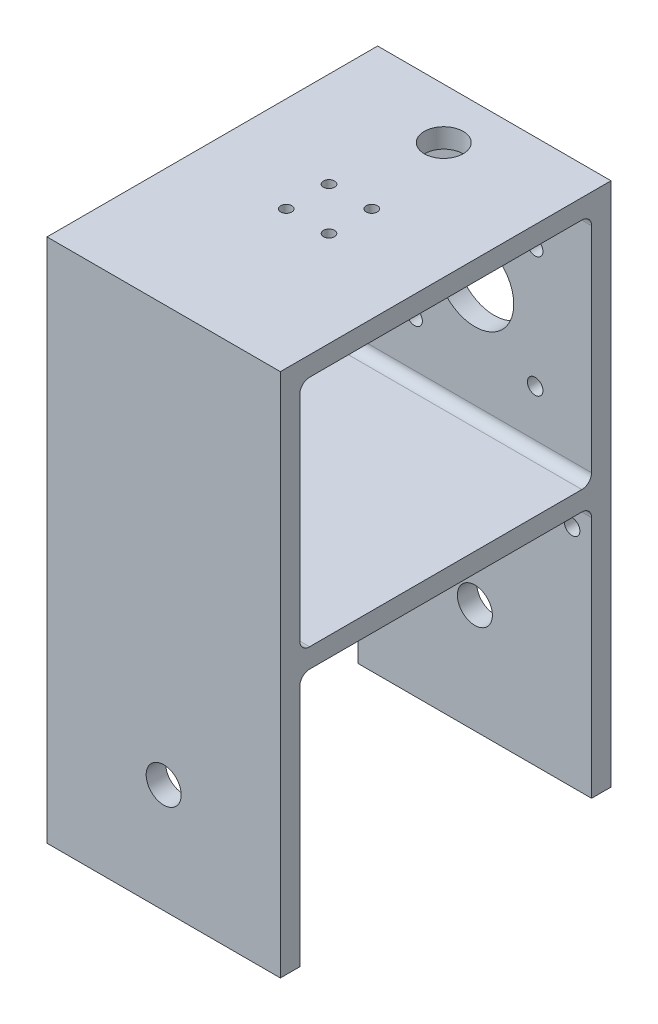
ISO-10303-21;
HEADER;
FILE_DESCRIPTION(('STEP AP214'),'2;1');
FILE_NAME('part.step','',(''),(''),'','','');
FILE_SCHEMA(('AUTOMOTIVE_DESIGN { 1 0 10303 214 1 1 1 1 }'));
ENDSEC;
DATA;
#1=APPLICATION_CONTEXT('core data for automotive mechanical design processes');
#2=APPLICATION_PROTOCOL_DEFINITION('international standard','automotive_design',2000,#1);
#3=PRODUCT_CONTEXT('',#1,'mechanical');
#4=PRODUCT('Part','Part','',(#3));
#5=PRODUCT_RELATED_PRODUCT_CATEGORY('part','',(#4));
#6=PRODUCT_DEFINITION_FORMATION('','',#4);
#7=PRODUCT_DEFINITION_CONTEXT('part definition',#1,'design');
#8=PRODUCT_DEFINITION('design','',#6,#7);
#9=PRODUCT_DEFINITION_SHAPE('','',#8);
#10=(LENGTH_UNIT() NAMED_UNIT(*) SI_UNIT(.MILLI.,.METRE.));
#11=(NAMED_UNIT(*) PLANE_ANGLE_UNIT() SI_UNIT($,.RADIAN.));
#12=(NAMED_UNIT(*) SI_UNIT($,.STERADIAN.) SOLID_ANGLE_UNIT());
#13=UNCERTAINTY_MEASURE_WITH_UNIT(LENGTH_MEASURE(1.E-05),#10,'distance_accuracy_value','');
#14=(GEOMETRIC_REPRESENTATION_CONTEXT(3) GLOBAL_UNCERTAINTY_ASSIGNED_CONTEXT((#13)) GLOBAL_UNIT_ASSIGNED_CONTEXT((#10,
#11,#12)) REPRESENTATION_CONTEXT('',''));
#15=CARTESIAN_POINT('',(0.,0.,0.));
#16=DIRECTION('',(0.,0.,1.));
#17=DIRECTION('',(1.,0.,0.));
#18=AXIS2_PLACEMENT_3D('',#15,#16,#17);
#19=CARTESIAN_POINT('',(-60.,0.,85.));
#20=DIRECTION('',(0.,1.,0.));
#21=DIRECTION('',(0.,0.,1.));
#22=AXIS2_PLACEMENT_3D('',#19,#20,#21);
#23=PLANE('',#22);
#24=CARTESIAN_POINT('',(-24.5,0.,37.));
#25=DIRECTION('',(0.,1.,0.));
#26=DIRECTION('',(0.,0.,1.));
#27=AXIS2_PLACEMENT_3D('',#24,#25,#26);
#28=CIRCLE('',#27,1.425);
#29=CARTESIAN_POINT('',(-24.5,0.,38.425));
#30=VERTEX_POINT('',#29);
#31=EDGE_CURVE('E503',#30,#30,#28,.T.);
#32=ORIENTED_EDGE('',*,*,#31,.F.);
#33=EDGE_LOOP('',(#32));
#34=FACE_BOUND('',#33,.T.);
#35=CARTESIAN_POINT('',(-24.5,0.,48.));
#36=DIRECTION('',(0.,1.,0.));
#37=DIRECTION('',(0.,0.,1.));
#38=AXIS2_PLACEMENT_3D('',#35,#36,#37);
#39=CIRCLE('',#38,1.425);
#40=CARTESIAN_POINT('',(-24.5,0.,49.425));
#41=VERTEX_POINT('',#40);
#42=EDGE_CURVE('E498',#41,#41,#39,.T.);
#43=ORIENTED_EDGE('',*,*,#42,.F.);
#44=EDGE_LOOP('',(#43));
#45=FACE_BOUND('',#44,.T.);
#46=CARTESIAN_POINT('',(-35.5,0.,48.));
#47=DIRECTION('',(0.,1.,0.));
#48=DIRECTION('',(0.,0.,1.));
#49=AXIS2_PLACEMENT_3D('',#46,#47,#48);
#50=CIRCLE('',#49,1.425);
#51=CARTESIAN_POINT('',(-35.5,0.,49.425));
#52=VERTEX_POINT('',#51);
#53=EDGE_CURVE('E491',#52,#52,#50,.T.);
#54=ORIENTED_EDGE('',*,*,#53,.F.);
#55=EDGE_LOOP('',(#54));
#56=FACE_BOUND('',#55,.T.);
#57=CARTESIAN_POINT('',(-30.,0.,13.));
#58=DIRECTION('',(0.,1.,0.));
#59=DIRECTION('',(0.,0.,1.));
#60=AXIS2_PLACEMENT_3D('',#57,#58,#59);
#61=CIRCLE('',#60,5.);
#62=CARTESIAN_POINT('',(-30.,0.,18.));
#63=VERTEX_POINT('',#62);
#64=EDGE_CURVE('E488',#63,#63,#61,.T.);
#65=ORIENTED_EDGE('',*,*,#64,.F.);
#66=EDGE_LOOP('',(#65));
#67=FACE_BOUND('',#66,.T.);
#68=CARTESIAN_POINT('',(-35.5,0.,37.));
#69=DIRECTION('',(0.,1.,0.));
#70=DIRECTION('',(0.,0.,1.));
#71=AXIS2_PLACEMENT_3D('',#68,#69,#70);
#72=CIRCLE('',#71,1.425);
#73=CARTESIAN_POINT('',(-35.5,0.,38.425));
#74=VERTEX_POINT('',#73);
#75=EDGE_CURVE('E299',#74,#74,#72,.T.);
#76=ORIENTED_EDGE('',*,*,#75,.F.);
#77=EDGE_LOOP('',(#76));
#78=FACE_BOUND('',#77,.T.);
#79=DIRECTION('',(0.,0.,1.));
#80=VECTOR('',#79,1.);
#81=CARTESIAN_POINT('',(0.,0.,85.));
#82=LINE('',#81,#80);
#83=CARTESIAN_POINT('',(0.,0.,0.));
#84=VERTEX_POINT('',#83);
#85=CARTESIAN_POINT('',(0.,0.,85.));
#86=VERTEX_POINT('',#85);
#87=EDGE_CURVE('E204',#84,#86,#82,.T.);
#88=ORIENTED_EDGE('',*,*,#87,.F.);
#89=DIRECTION('',(1.,0.,0.));
#90=VECTOR('',#89,1.);
#91=CARTESIAN_POINT('',(-60.,0.,0.));
#92=LINE('',#91,#90);
#93=CARTESIAN_POINT('',(-60.,0.,0.));
#94=VERTEX_POINT('',#93);
#95=EDGE_CURVE('E181',#94,#84,#92,.T.);
#96=ORIENTED_EDGE('',*,*,#95,.F.);
#97=DIRECTION('',(0.,0.,1.));
#98=VECTOR('',#97,1.);
#99=CARTESIAN_POINT('',(-60.,0.,85.));
#100=LINE('',#99,#98);
#101=CARTESIAN_POINT('',(-60.,0.,85.));
#102=VERTEX_POINT('',#101);
#103=EDGE_CURVE('E175',#94,#102,#100,.T.);
#104=ORIENTED_EDGE('',*,*,#103,.T.);
#105=DIRECTION('',(1.,0.,0.));
#106=VECTOR('',#105,1.);
#107=CARTESIAN_POINT('',(-60.,0.,85.));
#108=LINE('',#107,#106);
#109=EDGE_CURVE('E157',#102,#86,#108,.T.);
#110=ORIENTED_EDGE('',*,*,#109,.T.);
#111=EDGE_LOOP('',(#88,#96,#104,#110));
#112=FACE_BOUND('',#111,.T.);
#113=ADVANCED_FACE('F32',(#34,#45,#56,#67,#78,#112),#23,.T.);
#114=CARTESIAN_POINT('',(-60.,0.,0.));
#115=DIRECTION('',(0.,0.,-1.));
#116=DIRECTION('',(0.,1.,0.));
#117=AXIS2_PLACEMENT_3D('',#114,#115,#116);
#118=PLANE('',#117);
#119=CARTESIAN_POINT('',(-45.5,-50.5,0.));
#120=DIRECTION('',(0.,0.,1.));
#121=DIRECTION('',(1.,0.,0.));
#122=AXIS2_PLACEMENT_3D('',#119,#120,#121);
#123=CIRCLE('',#122,2.);
#124=CARTESIAN_POINT('',(-43.5,-50.5,0.));
#125=VERTEX_POINT('',#124);
#126=EDGE_CURVE('E468',#125,#125,#123,.T.);
#127=ORIENTED_EDGE('',*,*,#126,.T.);
#128=EDGE_LOOP('',(#127));
#129=FACE_BOUND('',#128,.T.);
#130=CARTESIAN_POINT('',(-30.,-35.,0.));
#131=DIRECTION('',(0.,0.,1.));
#132=DIRECTION('',(1.,0.,0.));
#133=AXIS2_PLACEMENT_3D('',#130,#131,#132);
#134=CIRCLE('',#133,10.);
#135=CARTESIAN_POINT('',(-20.,-35.,0.));
#136=VERTEX_POINT('',#135);
#137=EDGE_CURVE('E461',#136,#136,#134,.T.);
#138=ORIENTED_EDGE('',*,*,#137,.T.);
#139=EDGE_LOOP('',(#138));
#140=FACE_BOUND('',#139,.T.);
#141=CARTESIAN_POINT('',(-30.,-107.,0.));
#142=DIRECTION('',(0.,0.,1.));
#143=DIRECTION('',(1.,0.,0.));
#144=AXIS2_PLACEMENT_3D('',#141,#142,#143);
#145=CIRCLE('',#144,4.5);
#146=CARTESIAN_POINT('',(-25.5,-107.,0.));
#147=VERTEX_POINT('',#146);
#148=EDGE_CURVE('E464',#147,#147,#145,.T.);
#149=ORIENTED_EDGE('',*,*,#148,.T.);
#150=EDGE_LOOP('',(#149));
#151=FACE_BOUND('',#150,.T.);
#152=CARTESIAN_POINT('',(-45.5,-19.5,0.));
#153=DIRECTION('',(0.,0.,1.));
#154=DIRECTION('',(1.,0.,0.));
#155=AXIS2_PLACEMENT_3D('',#152,#153,#154);
#156=CIRCLE('',#155,2.);
#157=CARTESIAN_POINT('',(-43.5,-19.5,0.));
#158=VERTEX_POINT('',#157);
#159=EDGE_CURVE('E473',#158,#158,#156,.T.);
#160=ORIENTED_EDGE('',*,*,#159,.T.);
#161=EDGE_LOOP('',(#160));
#162=FACE_BOUND('',#161,.T.);
#163=CARTESIAN_POINT('',(-14.5,-50.5,0.));
#164=DIRECTION('',(0.,0.,1.));
#165=DIRECTION('',(1.,0.,0.));
#166=AXIS2_PLACEMENT_3D('',#163,#164,#165);
#167=CIRCLE('',#166,2.);
#168=CARTESIAN_POINT('',(-12.5,-50.5,0.));
#169=VERTEX_POINT('',#168);
#170=EDGE_CURVE('E446',#169,#169,#167,.T.);
#171=ORIENTED_EDGE('',*,*,#170,.T.);
#172=EDGE_LOOP('',(#171));
#173=FACE_BOUND('',#172,.T.);
#174=CARTESIAN_POINT('',(-55.,-77.,0.));
#175=DIRECTION('',(0.,0.,1.));
#176=DIRECTION('',(1.,0.,0.));
#177=AXIS2_PLACEMENT_3D('',#174,#175,#176);
#178=CIRCLE('',#177,2.);
#179=CARTESIAN_POINT('',(-53.,-77.,0.));
#180=VERTEX_POINT('',#179);
#181=EDGE_CURVE('E456',#180,#180,#178,.T.);
#182=ORIENTED_EDGE('',*,*,#181,.T.);
#183=EDGE_LOOP('',(#182));
#184=FACE_BOUND('',#183,.T.);
#185=CARTESIAN_POINT('',(-5.,-77.,0.));
#186=DIRECTION('',(0.,0.,1.));
#187=DIRECTION('',(1.,0.,0.));
#188=AXIS2_PLACEMENT_3D('',#185,#186,#187);
#189=CIRCLE('',#188,2.);
#190=CARTESIAN_POINT('',(-3.,-77.,0.));
#191=VERTEX_POINT('',#190);
#192=EDGE_CURVE('E437',#191,#191,#189,.T.);
#193=ORIENTED_EDGE('',*,*,#192,.T.);
#194=EDGE_LOOP('',(#193));
#195=FACE_BOUND('',#194,.T.);
#196=CARTESIAN_POINT('',(-14.5,-19.5,0.));
#197=DIRECTION('',(0.,0.,1.));
#198=DIRECTION('',(1.,0.,0.));
#199=AXIS2_PLACEMENT_3D('',#196,#197,#198);
#200=CIRCLE('',#199,2.);
#201=CARTESIAN_POINT('',(-12.5,-19.5,0.));
#202=VERTEX_POINT('',#201);
#203=EDGE_CURVE('E485',#202,#202,#200,.T.);
#204=ORIENTED_EDGE('',*,*,#203,.T.);
#205=EDGE_LOOP('',(#204));
#206=FACE_BOUND('',#205,.T.);
#207=DIRECTION('',(0.,1.,0.));
#208=VECTOR('',#207,1.);
#209=CARTESIAN_POINT('',(0.,0.,0.));
#210=LINE('',#209,#208);
#211=CARTESIAN_POINT('',(0.,-135.,0.));
#212=VERTEX_POINT('',#211);
#213=EDGE_CURVE('E182',#212,#84,#210,.T.);
#214=ORIENTED_EDGE('',*,*,#213,.F.);
#215=DIRECTION('',(1.,0.,0.));
#216=VECTOR('',#215,1.);
#217=CARTESIAN_POINT('',(-60.,-135.,0.));
#218=LINE('',#217,#216);
#219=CARTESIAN_POINT('',(-60.,-135.,0.));
#220=VERTEX_POINT('',#219);
#221=EDGE_CURVE('E223',#220,#212,#218,.T.);
#222=ORIENTED_EDGE('',*,*,#221,.F.);
#223=DIRECTION('',(0.,1.,0.));
#224=VECTOR('',#223,1.);
#225=CARTESIAN_POINT('',(-60.,0.,0.));
#226=LINE('',#225,#224);
#227=EDGE_CURVE('E168',#220,#94,#226,.T.);
#228=ORIENTED_EDGE('',*,*,#227,.T.);
#229=ORIENTED_EDGE('',*,*,#95,.T.);
#230=EDGE_LOOP('',(#214,#222,#228,#229));
#231=FACE_BOUND('',#230,.T.);
#232=ADVANCED_FACE('F330',(#129,#140,#151,#162,#173,#184,#195,#206,#231),#118,.T.);
#233=CARTESIAN_POINT('',(-60.,-135.,0.));
#234=DIRECTION('',(0.,-1.,0.));
#235=DIRECTION('',(0.,0.,-1.));
#236=AXIS2_PLACEMENT_3D('',#233,#234,#235);
#237=PLANE('',#236);
#238=DIRECTION('',(0.,0.,-1.));
#239=VECTOR('',#238,1.);
#240=CARTESIAN_POINT('',(0.,-135.,0.));
#241=LINE('',#240,#239);
#242=CARTESIAN_POINT('',(0.,-135.,4.99999999999998));
#243=VERTEX_POINT('',#242);
#244=EDGE_CURVE('E185',#243,#212,#241,.T.);
#245=ORIENTED_EDGE('',*,*,#244,.F.);
#246=DIRECTION('',(1.,0.,0.));
#247=VECTOR('',#246,1.);
#248=CARTESIAN_POINT('',(-60.,-135.,4.99999999999998));
#249=LINE('',#248,#247);
#250=CARTESIAN_POINT('',(-60.,-135.,4.99999999999998));
#251=VERTEX_POINT('',#250);
#252=EDGE_CURVE('E225',#251,#243,#249,.T.);
#253=ORIENTED_EDGE('',*,*,#252,.F.);
#254=DIRECTION('',(0.,0.,-1.));
#255=VECTOR('',#254,1.);
#256=CARTESIAN_POINT('',(-60.,-135.,0.));
#257=LINE('',#256,#255);
#258=EDGE_CURVE('E200',#251,#220,#257,.T.);
#259=ORIENTED_EDGE('',*,*,#258,.T.);
#260=ORIENTED_EDGE('',*,*,#221,.T.);
#261=EDGE_LOOP('',(#245,#253,#259,#260));
#262=FACE_BOUND('',#261,.T.);
#263=ADVANCED_FACE('F336',(#262),#237,.T.);
#264=CARTESIAN_POINT('',(-60.,-135.,4.99999999999998));
#265=DIRECTION('',(0.,0.,1.));
#266=DIRECTION('',(0.,-1.,0.));
#267=AXIS2_PLACEMENT_3D('',#264,#265,#266);
#268=PLANE('',#267);
#269=CARTESIAN_POINT('',(-30.,-107.,4.99999999999999));
#270=DIRECTION('',(0.,0.,1.));
#271=DIRECTION('',(0.,-1.,0.));
#272=AXIS2_PLACEMENT_3D('',#269,#270,#271);
#273=CIRCLE('',#272,4.5);
#274=CARTESIAN_POINT('',(-30.,-111.5,4.99999999999999));
#275=VERTEX_POINT('',#274);
#276=EDGE_CURVE('E480',#275,#275,#273,.T.);
#277=ORIENTED_EDGE('',*,*,#276,.F.);
#278=EDGE_LOOP('',(#277));
#279=FACE_BOUND('',#278,.T.);
#280=CARTESIAN_POINT('',(-55.,-77.,4.99999999999999));
#281=DIRECTION('',(0.,0.,1.));
#282=DIRECTION('',(0.,-1.,0.));
#283=AXIS2_PLACEMENT_3D('',#280,#281,#282);
#284=CIRCLE('',#283,2.);
#285=CARTESIAN_POINT('',(-55.,-79.,4.99999999999999));
#286=VERTEX_POINT('',#285);
#287=EDGE_CURVE('E453',#286,#286,#284,.T.);
#288=ORIENTED_EDGE('',*,*,#287,.F.);
#289=EDGE_LOOP('',(#288));
#290=FACE_BOUND('',#289,.T.);
#291=CARTESIAN_POINT('',(-5.,-77.,4.99999999999999));
#292=DIRECTION('',(0.,0.,1.));
#293=DIRECTION('',(0.,-1.,0.));
#294=AXIS2_PLACEMENT_3D('',#291,#292,#293);
#295=CIRCLE('',#294,2.);
#296=CARTESIAN_POINT('',(-5.,-79.,4.99999999999999));
#297=VERTEX_POINT('',#296);
#298=EDGE_CURVE('E441',#297,#297,#295,.T.);
#299=ORIENTED_EDGE('',*,*,#298,.F.);
#300=EDGE_LOOP('',(#299));
#301=FACE_BOUND('',#300,.T.);
#302=DIRECTION('',(0.,-1.,0.));
#303=VECTOR('',#302,1.);
#304=CARTESIAN_POINT('',(0.,-135.,4.99999999999998));
#305=LINE('',#304,#303);
#306=CARTESIAN_POINT('',(0.,-72.5,4.99999999999998));
#307=VERTEX_POINT('',#306);
#308=EDGE_CURVE('E217',#307,#243,#305,.T.);
#309=ORIENTED_EDGE('',*,*,#308,.F.);
#310=DIRECTION('',(1.,0.,0.));
#311=VECTOR('',#310,1.);
#312=CARTESIAN_POINT('',(-60.,-72.5,4.99999999999998));
#313=LINE('',#312,#311);
#314=CARTESIAN_POINT('',(-60.,-72.5,4.99999999999998));
#315=VERTEX_POINT('',#314);
#316=EDGE_CURVE('E242',#307,#315,#313,.F.);
#317=ORIENTED_EDGE('',*,*,#316,.T.);
#318=DIRECTION('',(0.,-1.,0.));
#319=VECTOR('',#318,1.);
#320=CARTESIAN_POINT('',(-60.,-135.,4.99999999999998));
#321=LINE('',#320,#319);
#322=EDGE_CURVE('E198',#315,#251,#321,.T.);
#323=ORIENTED_EDGE('',*,*,#322,.T.);
#324=ORIENTED_EDGE('',*,*,#252,.T.);
#325=EDGE_LOOP('',(#309,#317,#323,#324));
#326=FACE_BOUND('',#325,.T.);
#327=ADVANCED_FACE('F393',(#279,#290,#301,#326),#268,.T.);
#328=CARTESIAN_POINT('',(-60.,-70.,4.99999999999998));
#329=DIRECTION('',(0.,-1.,0.));
#330=DIRECTION('',(0.,0.,-1.));
#331=AXIS2_PLACEMENT_3D('',#328,#329,#330);
#332=PLANE('',#331);
#333=DIRECTION('',(0.,0.,-1.));
#334=VECTOR('',#333,1.);
#335=CARTESIAN_POINT('',(-60.,-70.,4.99999999999998));
#336=LINE('',#335,#334);
#337=CARTESIAN_POINT('',(-60.,-70.,77.5));
#338=VERTEX_POINT('',#337);
#339=CARTESIAN_POINT('',(-60.,-70.,7.49999999999999));
#340=VERTEX_POINT('',#339);
#341=EDGE_CURVE('E195',#338,#340,#336,.T.);
#342=ORIENTED_EDGE('',*,*,#341,.T.);
#343=DIRECTION('',(1.,0.,0.));
#344=VECTOR('',#343,1.);
#345=CARTESIAN_POINT('',(0.,-70.,7.49999999999999));
#346=LINE('',#345,#344);
#347=CARTESIAN_POINT('',(0.,-70.,7.49999999999999));
#348=VERTEX_POINT('',#347);
#349=EDGE_CURVE('E239',#340,#348,#346,.T.);
#350=ORIENTED_EDGE('',*,*,#349,.T.);
#351=DIRECTION('',(0.,0.,-1.));
#352=VECTOR('',#351,1.);
#353=CARTESIAN_POINT('',(0.,-70.,4.99999999999998));
#354=LINE('',#353,#352);
#355=CARTESIAN_POINT('',(0.,-70.,77.5));
#356=VERTEX_POINT('',#355);
#357=EDGE_CURVE('E214',#356,#348,#354,.T.);
#358=ORIENTED_EDGE('',*,*,#357,.F.);
#359=DIRECTION('',(1.,0.,0.));
#360=VECTOR('',#359,1.);
#361=CARTESIAN_POINT('',(-60.,-70.,77.5));
#362=LINE('',#361,#360);
#363=EDGE_CURVE('E233',#356,#338,#362,.F.);
#364=ORIENTED_EDGE('',*,*,#363,.T.);
#365=EDGE_LOOP('',(#342,#350,#358,#364));
#366=FACE_BOUND('',#365,.T.);
#367=ADVANCED_FACE('F397',(#366),#332,.T.);
#368=CARTESIAN_POINT('',(-60.,-70.,80.));
#369=DIRECTION('',(0.,0.,-1.));
#370=DIRECTION('',(-1.,0.,0.));
#371=AXIS2_PLACEMENT_3D('',#368,#369,#370);
#372=PLANE('',#371);
#373=CARTESIAN_POINT('',(-30.,-107.,80.));
#374=DIRECTION('',(0.,0.,-1.));
#375=DIRECTION('',(-1.,0.,0.));
#376=AXIS2_PLACEMENT_3D('',#373,#374,#375);
#377=CIRCLE('',#376,4.5);
#378=CARTESIAN_POINT('',(-34.5,-107.,80.));
#379=VERTEX_POINT('',#378);
#380=EDGE_CURVE('E438',#379,#379,#377,.F.);
#381=ORIENTED_EDGE('',*,*,#380,.T.);
#382=EDGE_LOOP('',(#381));
#383=FACE_BOUND('',#382,.T.);
#384=DIRECTION('',(0.,1.,0.));
#385=VECTOR('',#384,1.);
#386=CARTESIAN_POINT('',(-60.,-70.,80.));
#387=LINE('',#386,#385);
#388=CARTESIAN_POINT('',(-60.,-135.,80.));
#389=VERTEX_POINT('',#388);
#390=CARTESIAN_POINT('',(-60.,-72.5,80.));
#391=VERTEX_POINT('',#390);
#392=EDGE_CURVE('E192',#389,#391,#387,.T.);
#393=ORIENTED_EDGE('',*,*,#392,.T.);
#394=DIRECTION('',(1.,0.,0.));
#395=VECTOR('',#394,1.);
#396=CARTESIAN_POINT('',(0.,-72.5,80.));
#397=LINE('',#396,#395);
#398=CARTESIAN_POINT('',(0.,-72.5,80.));
#399=VERTEX_POINT('',#398);
#400=EDGE_CURVE('E222',#391,#399,#397,.T.);
#401=ORIENTED_EDGE('',*,*,#400,.T.);
#402=DIRECTION('',(0.,1.,0.));
#403=VECTOR('',#402,1.);
#404=CARTESIAN_POINT('',(0.,-70.,80.));
#405=LINE('',#404,#403);
#406=CARTESIAN_POINT('',(0.,-135.,80.));
#407=VERTEX_POINT('',#406);
#408=EDGE_CURVE('E211',#407,#399,#405,.T.);
#409=ORIENTED_EDGE('',*,*,#408,.F.);
#410=DIRECTION('',(1.,0.,0.));
#411=VECTOR('',#410,1.);
#412=CARTESIAN_POINT('',(-60.,-135.,80.));
#413=LINE('',#412,#411);
#414=EDGE_CURVE('E228',#389,#407,#413,.T.);
#415=ORIENTED_EDGE('',*,*,#414,.F.);
#416=EDGE_LOOP('',(#393,#401,#409,#415));
#417=FACE_BOUND('',#416,.T.);
#418=ADVANCED_FACE('F401',(#383,#417),#372,.T.);
#419=CARTESIAN_POINT('',(-60.,-135.,80.));
#420=DIRECTION('',(0.,-1.,0.));
#421=DIRECTION('',(0.,0.,-1.));
#422=AXIS2_PLACEMENT_3D('',#419,#420,#421);
#423=PLANE('',#422);
#424=DIRECTION('',(0.,0.,-1.));
#425=VECTOR('',#424,1.);
#426=CARTESIAN_POINT('',(0.,-135.,80.));
#427=LINE('',#426,#425);
#428=CARTESIAN_POINT('',(0.,-135.,85.));
#429=VERTEX_POINT('',#428);
#430=EDGE_CURVE('E208',#429,#407,#427,.T.);
#431=ORIENTED_EDGE('',*,*,#430,.F.);
#432=DIRECTION('',(1.,0.,0.));
#433=VECTOR('',#432,1.);
#434=CARTESIAN_POINT('',(-60.,-135.,85.));
#435=LINE('',#434,#433);
#436=CARTESIAN_POINT('',(-60.,-135.,85.));
#437=VERTEX_POINT('',#436);
#438=EDGE_CURVE('E167',#437,#429,#435,.T.);
#439=ORIENTED_EDGE('',*,*,#438,.F.);
#440=DIRECTION('',(0.,0.,-1.));
#441=VECTOR('',#440,1.);
#442=CARTESIAN_POINT('',(-60.,-135.,80.));
#443=LINE('',#442,#441);
#444=EDGE_CURVE('E179',#437,#389,#443,.T.);
#445=ORIENTED_EDGE('',*,*,#444,.T.);
#446=ORIENTED_EDGE('',*,*,#414,.T.);
#447=EDGE_LOOP('',(#431,#439,#445,#446));
#448=FACE_BOUND('',#447,.T.);
#449=ADVANCED_FACE('F404',(#448),#423,.T.);
#450=CARTESIAN_POINT('',(-60.,-135.,85.));
#451=DIRECTION('',(0.,0.,1.));
#452=DIRECTION('',(1.,0.,0.));
#453=AXIS2_PLACEMENT_3D('',#450,#451,#452);
#454=PLANE('',#453);
#455=CARTESIAN_POINT('',(-30.,-107.,85.));
#456=DIRECTION('',(0.,0.,1.));
#457=DIRECTION('',(1.,0.,0.));
#458=AXIS2_PLACEMENT_3D('',#455,#456,#457);
#459=CIRCLE('',#458,4.5);
#460=CARTESIAN_POINT('',(-25.5,-107.,85.));
#461=VERTEX_POINT('',#460);
#462=EDGE_CURVE('E435',#461,#461,#459,.T.);
#463=ORIENTED_EDGE('',*,*,#462,.F.);
#464=EDGE_LOOP('',(#463));
#465=FACE_BOUND('',#464,.T.);
#466=DIRECTION('',(0.,-1.,0.));
#467=VECTOR('',#466,1.);
#468=CARTESIAN_POINT('',(0.,-135.,85.));
#469=LINE('',#468,#467);
#470=EDGE_CURVE('E162',#86,#429,#469,.T.);
#471=ORIENTED_EDGE('',*,*,#470,.F.);
#472=ORIENTED_EDGE('',*,*,#109,.F.);
#473=DIRECTION('',(0.,-1.,0.));
#474=VECTOR('',#473,1.);
#475=CARTESIAN_POINT('',(-60.,-135.,85.));
#476=LINE('',#475,#474);
#477=EDGE_CURVE('E160',#102,#437,#476,.T.);
#478=ORIENTED_EDGE('',*,*,#477,.T.);
#479=ORIENTED_EDGE('',*,*,#438,.T.);
#480=EDGE_LOOP('',(#471,#472,#478,#479));
#481=FACE_BOUND('',#480,.T.);
#482=ADVANCED_FACE('F159',(#465,#481),#454,.T.);
#483=CARTESIAN_POINT('',(-60.,0.,0.));
#484=DIRECTION('',(-1.,0.,0.));
#485=DIRECTION('',(0.,0.,1.));
#486=AXIS2_PLACEMENT_3D('',#483,#484,#485);
#487=PLANE('',#486);
#488=DIRECTION('',(0.,0.,1.));
#489=VECTOR('',#488,1.);
#490=CARTESIAN_POINT('',(-60.,-5.,80.));
#491=LINE('',#490,#489);
#492=CARTESIAN_POINT('',(-60.,-5.,7.49999999999999));
#493=VERTEX_POINT('',#492);
#494=CARTESIAN_POINT('',(-60.,-5.,77.5));
#495=VERTEX_POINT('',#494);
#496=EDGE_CURVE('E206',#493,#495,#491,.T.);
#497=ORIENTED_EDGE('',*,*,#496,.T.);
#498=CARTESIAN_POINT('',(-60.,-7.5,77.5));
#499=DIRECTION('',(-1.,0.,0.));
#500=DIRECTION('',(0.,0.,1.));
#501=AXIS2_PLACEMENT_3D('',#498,#499,#500);
#502=CIRCLE('',#501,2.5);
#503=CARTESIAN_POINT('',(-60.,-7.5,80.));
#504=VERTEX_POINT('',#503);
#505=EDGE_CURVE('E11',#495,#504,#502,.F.);
#506=ORIENTED_EDGE('',*,*,#505,.T.);
#507=DIRECTION('',(0.,-1.,0.));
#508=VECTOR('',#507,1.);
#509=CARTESIAN_POINT('',(-60.,-65.,80.));
#510=LINE('',#509,#508);
#511=CARTESIAN_POINT('',(-60.,-62.5,80.));
#512=VERTEX_POINT('',#511);
#513=EDGE_CURVE('E285',#504,#512,#510,.T.);
#514=ORIENTED_EDGE('',*,*,#513,.T.);
#515=CARTESIAN_POINT('',(-60.,-62.5,77.5));
#516=DIRECTION('',(-1.,0.,0.));
#517=DIRECTION('',(0.,0.,1.));
#518=AXIS2_PLACEMENT_3D('',#515,#516,#517);
#519=CIRCLE('',#518,2.5);
#520=CARTESIAN_POINT('',(-60.,-65.,77.5));
#521=VERTEX_POINT('',#520);
#522=EDGE_CURVE('E257',#512,#521,#519,.F.);
#523=ORIENTED_EDGE('',*,*,#522,.T.);
#524=DIRECTION('',(0.,0.,-1.));
#525=VECTOR('',#524,1.);
#526=CARTESIAN_POINT('',(-60.,-65.,80.));
#527=LINE('',#526,#525);
#528=CARTESIAN_POINT('',(-60.,-65.,7.49999999999999));
#529=VERTEX_POINT('',#528);
#530=EDGE_CURVE('E307',#521,#529,#527,.T.);
#531=ORIENTED_EDGE('',*,*,#530,.T.);
#532=CARTESIAN_POINT('',(-60.,-62.5,7.49999999999999));
#533=DIRECTION('',(-1.,0.,0.));
#534=DIRECTION('',(0.,0.,1.));
#535=AXIS2_PLACEMENT_3D('',#532,#533,#534);
#536=CIRCLE('',#535,2.5);
#537=CARTESIAN_POINT('',(-60.,-62.5,4.99999999999999));
#538=VERTEX_POINT('',#537);
#539=EDGE_CURVE('E266',#529,#538,#536,.F.);
#540=ORIENTED_EDGE('',*,*,#539,.T.);
#541=DIRECTION('',(0.,1.,0.));
#542=VECTOR('',#541,1.);
#543=CARTESIAN_POINT('',(-60.,-65.,4.99999999999999));
#544=LINE('',#543,#542);
#545=CARTESIAN_POINT('',(-60.,-7.5,4.99999999999999));
#546=VERTEX_POINT('',#545);
#547=EDGE_CURVE('E311',#538,#546,#544,.T.);
#548=ORIENTED_EDGE('',*,*,#547,.T.);
#549=CARTESIAN_POINT('',(-60.,-7.5,7.49999999999999));
#550=DIRECTION('',(-1.,0.,0.));
#551=DIRECTION('',(0.,0.,1.));
#552=AXIS2_PLACEMENT_3D('',#549,#550,#551);
#553=CIRCLE('',#552,2.5);
#554=EDGE_CURVE('E275',#546,#493,#553,.F.);
#555=ORIENTED_EDGE('',*,*,#554,.T.);
#556=EDGE_LOOP('',(#497,#506,#514,#523,#531,#540,#548,#555));
#557=FACE_BOUND('',#556,.T.);
#558=ORIENTED_EDGE('',*,*,#103,.F.);
#559=ORIENTED_EDGE('',*,*,#227,.F.);
#560=ORIENTED_EDGE('',*,*,#258,.F.);
#561=ORIENTED_EDGE('',*,*,#322,.F.);
#562=CARTESIAN_POINT('',(-60.,-72.5,7.49999999999998));
#563=DIRECTION('',(-1.,0.,0.));
#564=DIRECTION('',(0.,0.,1.));
#565=AXIS2_PLACEMENT_3D('',#562,#563,#564);
#566=CIRCLE('',#565,2.5);
#567=EDGE_CURVE('E246',#315,#340,#566,.F.);
#568=ORIENTED_EDGE('',*,*,#567,.T.);
#569=ORIENTED_EDGE('',*,*,#341,.F.);
#570=CARTESIAN_POINT('',(-60.,-72.5,77.5));
#571=DIRECTION('',(-1.,0.,0.));
#572=DIRECTION('',(0.,0.,1.));
#573=AXIS2_PLACEMENT_3D('',#570,#571,#572);
#574=CIRCLE('',#573,2.5);
#575=EDGE_CURVE('E237',#338,#391,#574,.F.);
#576=ORIENTED_EDGE('',*,*,#575,.T.);
#577=ORIENTED_EDGE('',*,*,#392,.F.);
#578=ORIENTED_EDGE('',*,*,#444,.F.);
#579=ORIENTED_EDGE('',*,*,#477,.F.);
#580=EDGE_LOOP('',(#558,#559,#560,#561,#568,#569,#576,#577,#578,#579));
#581=FACE_BOUND('',#580,.T.);
#582=ADVANCED_FACE('F173',(#557,#581),#487,.T.);
#583=CARTESIAN_POINT('',(0.,0.,0.));
#584=DIRECTION('',(-1.,0.,0.));
#585=DIRECTION('',(0.,0.,1.));
#586=AXIS2_PLACEMENT_3D('',#583,#584,#585);
#587=PLANE('',#586);
#588=DIRECTION('',(0.,0.,-1.));
#589=VECTOR('',#588,1.);
#590=CARTESIAN_POINT('',(0.,-65.,80.));
#591=LINE('',#590,#589);
#592=CARTESIAN_POINT('',(0.,-65.,77.5));
#593=VERTEX_POINT('',#592);
#594=CARTESIAN_POINT('',(0.,-65.,7.49999999999999));
#595=VERTEX_POINT('',#594);
#596=EDGE_CURVE('E292',#593,#595,#591,.T.);
#597=ORIENTED_EDGE('',*,*,#596,.F.);
#598=CARTESIAN_POINT('',(0.,-62.5,77.5));
#599=DIRECTION('',(-1.,0.,0.));
#600=DIRECTION('',(0.,0.,1.));
#601=AXIS2_PLACEMENT_3D('',#598,#599,#600);
#602=CIRCLE('',#601,2.5);
#603=CARTESIAN_POINT('',(0.,-62.5,80.));
#604=VERTEX_POINT('',#603);
#605=EDGE_CURVE('E254',#593,#604,#602,.T.);
#606=ORIENTED_EDGE('',*,*,#605,.T.);
#607=DIRECTION('',(0.,-1.,0.));
#608=VECTOR('',#607,1.);
#609=CARTESIAN_POINT('',(0.,-65.,80.));
#610=LINE('',#609,#608);
#611=CARTESIAN_POINT('',(0.,-7.5,80.));
#612=VERTEX_POINT('',#611);
#613=EDGE_CURVE('E284',#612,#604,#610,.T.);
#614=ORIENTED_EDGE('',*,*,#613,.F.);
#615=CARTESIAN_POINT('',(0.,-7.5,77.5));
#616=DIRECTION('',(-1.,0.,0.));
#617=DIRECTION('',(0.,0.,1.));
#618=AXIS2_PLACEMENT_3D('',#615,#616,#617);
#619=CIRCLE('',#618,2.5);
#620=CARTESIAN_POINT('',(0.,-5.,77.5));
#621=VERTEX_POINT('',#620);
#622=EDGE_CURVE('E40',#612,#621,#619,.T.);
#623=ORIENTED_EDGE('',*,*,#622,.T.);
#624=DIRECTION('',(0.,0.,1.));
#625=VECTOR('',#624,1.);
#626=CARTESIAN_POINT('',(0.,-5.,80.));
#627=LINE('',#626,#625);
#628=CARTESIAN_POINT('',(0.,-5.,7.49999999999999));
#629=VERTEX_POINT('',#628);
#630=EDGE_CURVE('E188',#629,#621,#627,.T.);
#631=ORIENTED_EDGE('',*,*,#630,.F.);
#632=CARTESIAN_POINT('',(0.,-7.5,7.49999999999999));
#633=DIRECTION('',(-1.,0.,0.));
#634=DIRECTION('',(0.,0.,1.));
#635=AXIS2_PLACEMENT_3D('',#632,#633,#634);
#636=CIRCLE('',#635,2.5);
#637=CARTESIAN_POINT('',(0.,-7.5,4.99999999999999));
#638=VERTEX_POINT('',#637);
#639=EDGE_CURVE('E273',#629,#638,#636,.T.);
#640=ORIENTED_EDGE('',*,*,#639,.T.);
#641=DIRECTION('',(0.,1.,0.));
#642=VECTOR('',#641,1.);
#643=CARTESIAN_POINT('',(0.,-65.,4.99999999999999));
#644=LINE('',#643,#642);
#645=CARTESIAN_POINT('',(0.,-62.5,4.99999999999999));
#646=VERTEX_POINT('',#645);
#647=EDGE_CURVE('E296',#646,#638,#644,.T.);
#648=ORIENTED_EDGE('',*,*,#647,.F.);
#649=CARTESIAN_POINT('',(0.,-62.5,7.49999999999999));
#650=DIRECTION('',(-1.,0.,0.));
#651=DIRECTION('',(0.,0.,1.));
#652=AXIS2_PLACEMENT_3D('',#649,#650,#651);
#653=CIRCLE('',#652,2.5);
#654=EDGE_CURVE('E264',#646,#595,#653,.T.);
#655=ORIENTED_EDGE('',*,*,#654,.T.);
#656=EDGE_LOOP('',(#597,#606,#614,#623,#631,#640,#648,#655));
#657=FACE_BOUND('',#656,.T.);
#658=ORIENTED_EDGE('',*,*,#87,.T.);
#659=ORIENTED_EDGE('',*,*,#470,.T.);
#660=ORIENTED_EDGE('',*,*,#430,.T.);
#661=ORIENTED_EDGE('',*,*,#408,.T.);
#662=CARTESIAN_POINT('',(0.,-72.5,77.5));
#663=DIRECTION('',(-1.,0.,0.));
#664=DIRECTION('',(0.,0.,1.));
#665=AXIS2_PLACEMENT_3D('',#662,#663,#664);
#666=CIRCLE('',#665,2.5);
#667=EDGE_CURVE('E235',#399,#356,#666,.T.);
#668=ORIENTED_EDGE('',*,*,#667,.T.);
#669=ORIENTED_EDGE('',*,*,#357,.T.);
#670=CARTESIAN_POINT('',(0.,-72.5,7.49999999999998));
#671=DIRECTION('',(-1.,0.,0.));
#672=DIRECTION('',(0.,0.,1.));
#673=AXIS2_PLACEMENT_3D('',#670,#671,#672);
#674=CIRCLE('',#673,2.5);
#675=EDGE_CURVE('E244',#348,#307,#674,.T.);
#676=ORIENTED_EDGE('',*,*,#675,.T.);
#677=ORIENTED_EDGE('',*,*,#308,.T.);
#678=ORIENTED_EDGE('',*,*,#244,.T.);
#679=ORIENTED_EDGE('',*,*,#213,.T.);
#680=EDGE_LOOP('',(#658,#659,#660,#661,#668,#669,#676,#677,#678,#679));
#681=FACE_BOUND('',#680,.T.);
#682=ADVANCED_FACE('F289',(#657,#681),#587,.F.);
#683=CARTESIAN_POINT('',(-60.,-65.,80.));
#684=DIRECTION('',(0.,0.,1.));
#685=DIRECTION('',(1.,0.,0.));
#686=AXIS2_PLACEMENT_3D('',#683,#684,#685);
#687=PLANE('',#686);
#688=ORIENTED_EDGE('',*,*,#513,.F.);
#689=DIRECTION('',(1.,0.,0.));
#690=VECTOR('',#689,1.);
#691=CARTESIAN_POINT('',(0.,-7.5,80.));
#692=LINE('',#691,#690);
#693=EDGE_CURVE('E277',#504,#612,#692,.T.);
#694=ORIENTED_EDGE('',*,*,#693,.T.);
#695=ORIENTED_EDGE('',*,*,#613,.T.);
#696=DIRECTION('',(1.,0.,0.));
#697=VECTOR('',#696,1.);
#698=CARTESIAN_POINT('',(-60.,-62.5,80.));
#699=LINE('',#698,#697);
#700=EDGE_CURVE('E251',#604,#512,#699,.F.);
#701=ORIENTED_EDGE('',*,*,#700,.T.);
#702=EDGE_LOOP('',(#688,#694,#695,#701));
#703=FACE_BOUND('',#702,.T.);
#704=ADVANCED_FACE('F283',(#703),#687,.F.);
#705=CARTESIAN_POINT('',(-60.,-5.,80.));
#706=DIRECTION('',(0.,1.,0.));
#707=DIRECTION('',(0.,0.,1.));
#708=AXIS2_PLACEMENT_3D('',#705,#706,#707);
#709=PLANE('',#708);
#710=CARTESIAN_POINT('',(-24.5,-5.,37.));
#711=DIRECTION('',(0.,1.,0.));
#712=DIRECTION('',(0.,0.,1.));
#713=AXIS2_PLACEMENT_3D('',#710,#711,#712);
#714=CIRCLE('',#713,1.425);
#715=CARTESIAN_POINT('',(-24.5,-5.,38.425));
#716=VERTEX_POINT('',#715);
#717=EDGE_CURVE('E506',#716,#716,#714,.F.);
#718=ORIENTED_EDGE('',*,*,#717,.F.);
#719=EDGE_LOOP('',(#718));
#720=FACE_BOUND('',#719,.T.);
#721=CARTESIAN_POINT('',(-24.5,-5.,48.));
#722=DIRECTION('',(0.,1.,0.));
#723=DIRECTION('',(0.,0.,1.));
#724=AXIS2_PLACEMENT_3D('',#721,#722,#723);
#725=CIRCLE('',#724,1.425);
#726=CARTESIAN_POINT('',(-24.5,-5.,49.425));
#727=VERTEX_POINT('',#726);
#728=EDGE_CURVE('E507',#727,#727,#725,.F.);
#729=ORIENTED_EDGE('',*,*,#728,.F.);
#730=EDGE_LOOP('',(#729));
#731=FACE_BOUND('',#730,.T.);
#732=CARTESIAN_POINT('',(-35.5,-5.,48.));
#733=DIRECTION('',(0.,1.,0.));
#734=DIRECTION('',(0.,0.,1.));
#735=AXIS2_PLACEMENT_3D('',#732,#733,#734);
#736=CIRCLE('',#735,1.425);
#737=CARTESIAN_POINT('',(-35.5,-5.,49.425));
#738=VERTEX_POINT('',#737);
#739=EDGE_CURVE('E494',#738,#738,#736,.F.);
#740=ORIENTED_EDGE('',*,*,#739,.F.);
#741=EDGE_LOOP('',(#740));
#742=FACE_BOUND('',#741,.T.);
#743=CARTESIAN_POINT('',(-30.,-5.,13.));
#744=DIRECTION('',(0.,1.,0.));
#745=DIRECTION('',(0.,0.,1.));
#746=AXIS2_PLACEMENT_3D('',#743,#744,#745);
#747=CIRCLE('',#746,5.);
#748=CARTESIAN_POINT('',(-30.,-5.,18.));
#749=VERTEX_POINT('',#748);
#750=EDGE_CURVE('E495',#749,#749,#747,.F.);
#751=ORIENTED_EDGE('',*,*,#750,.F.);
#752=EDGE_LOOP('',(#751));
#753=FACE_BOUND('',#752,.T.);
#754=CARTESIAN_POINT('',(-35.5,-5.,37.));
#755=DIRECTION('',(0.,1.,0.));
#756=DIRECTION('',(0.,0.,1.));
#757=AXIS2_PLACEMENT_3D('',#754,#755,#756);
#758=CIRCLE('',#757,1.425);
#759=CARTESIAN_POINT('',(-35.5,-5.,38.425));
#760=VERTEX_POINT('',#759);
#761=EDGE_CURVE('E293',#760,#760,#758,.F.);
#762=ORIENTED_EDGE('',*,*,#761,.F.);
#763=EDGE_LOOP('',(#762));
#764=FACE_BOUND('',#763,.T.);
#765=ORIENTED_EDGE('',*,*,#630,.T.);
#766=DIRECTION('',(1.,0.,0.));
#767=VECTOR('',#766,1.);
#768=CARTESIAN_POINT('',(-60.,-5.,77.5));
#769=LINE('',#768,#767);
#770=EDGE_CURVE('E53',#621,#495,#769,.F.);
#771=ORIENTED_EDGE('',*,*,#770,.T.);
#772=ORIENTED_EDGE('',*,*,#496,.F.);
#773=DIRECTION('',(1.,0.,0.));
#774=VECTOR('',#773,1.);
#775=CARTESIAN_POINT('',(0.,-5.,7.49999999999999));
#776=LINE('',#775,#774);
#777=EDGE_CURVE('E268',#493,#629,#776,.T.);
#778=ORIENTED_EDGE('',*,*,#777,.T.);
#779=EDGE_LOOP('',(#765,#771,#772,#778));
#780=FACE_BOUND('',#779,.T.);
#781=ADVANCED_FACE('F366',(#720,#731,#742,#753,#764,#780),#709,.F.);
#782=CARTESIAN_POINT('',(-60.,-65.,4.99999999999999));
#783=DIRECTION('',(0.,0.,-1.));
#784=DIRECTION('',(-1.,0.,0.));
#785=AXIS2_PLACEMENT_3D('',#782,#783,#784);
#786=PLANE('',#785);
#787=CARTESIAN_POINT('',(-45.5,-50.5,4.99999999999999));
#788=DIRECTION('',(0.,0.,-1.));
#789=DIRECTION('',(-1.,0.,0.));
#790=AXIS2_PLACEMENT_3D('',#787,#788,#789);
#791=CIRCLE('',#790,2.);
#792=CARTESIAN_POINT('',(-47.5,-50.5,4.99999999999999));
#793=VERTEX_POINT('',#792);
#794=EDGE_CURVE('E449',#793,#793,#791,.T.);
#795=ORIENTED_EDGE('',*,*,#794,.T.);
#796=EDGE_LOOP('',(#795));
#797=FACE_BOUND('',#796,.T.);
#798=CARTESIAN_POINT('',(-30.,-35.,4.99999999999999));
#799=DIRECTION('',(0.,0.,-1.));
#800=DIRECTION('',(-1.,0.,0.));
#801=AXIS2_PLACEMENT_3D('',#798,#799,#800);
#802=CIRCLE('',#801,10.);
#803=CARTESIAN_POINT('',(-40.,-35.,4.99999999999999));
#804=VERTEX_POINT('',#803);
#805=EDGE_CURVE('E465',#804,#804,#802,.T.);
#806=ORIENTED_EDGE('',*,*,#805,.T.);
#807=EDGE_LOOP('',(#806));
#808=FACE_BOUND('',#807,.T.);
#809=CARTESIAN_POINT('',(-45.5,-19.5,4.99999999999999));
#810=DIRECTION('',(0.,0.,-1.));
#811=DIRECTION('',(-1.,0.,0.));
#812=AXIS2_PLACEMENT_3D('',#809,#810,#811);
#813=CIRCLE('',#812,2.);
#814=CARTESIAN_POINT('',(-47.5,-19.5,4.99999999999999));
#815=VERTEX_POINT('',#814);
#816=EDGE_CURVE('E477',#815,#815,#813,.T.);
#817=ORIENTED_EDGE('',*,*,#816,.T.);
#818=EDGE_LOOP('',(#817));
#819=FACE_BOUND('',#818,.T.);
#820=CARTESIAN_POINT('',(-14.5,-50.5,4.99999999999999));
#821=DIRECTION('',(0.,0.,-1.));
#822=DIRECTION('',(-1.,0.,0.));
#823=AXIS2_PLACEMENT_3D('',#820,#821,#822);
#824=CIRCLE('',#823,2.);
#825=CARTESIAN_POINT('',(-16.5,-50.5,4.99999999999999));
#826=VERTEX_POINT('',#825);
#827=EDGE_CURVE('E450',#826,#826,#824,.T.);
#828=ORIENTED_EDGE('',*,*,#827,.T.);
#829=EDGE_LOOP('',(#828));
#830=FACE_BOUND('',#829,.T.);
#831=CARTESIAN_POINT('',(-14.5,-19.5,4.99999999999999));
#832=DIRECTION('',(0.,0.,-1.));
#833=DIRECTION('',(-1.,0.,0.));
#834=AXIS2_PLACEMENT_3D('',#831,#832,#833);
#835=CIRCLE('',#834,2.);
#836=CARTESIAN_POINT('',(-16.5,-19.5,4.99999999999999));
#837=VERTEX_POINT('',#836);
#838=EDGE_CURVE('E476',#837,#837,#835,.T.);
#839=ORIENTED_EDGE('',*,*,#838,.T.);
#840=EDGE_LOOP('',(#839));
#841=FACE_BOUND('',#840,.T.);
#842=ORIENTED_EDGE('',*,*,#647,.T.);
#843=DIRECTION('',(1.,0.,0.));
#844=VECTOR('',#843,1.);
#845=CARTESIAN_POINT('',(-60.,-7.5,4.99999999999999));
#846=LINE('',#845,#844);
#847=EDGE_CURVE('E271',#638,#546,#846,.F.);
#848=ORIENTED_EDGE('',*,*,#847,.T.);
#849=ORIENTED_EDGE('',*,*,#547,.F.);
#850=DIRECTION('',(1.,0.,0.));
#851=VECTOR('',#850,1.);
#852=CARTESIAN_POINT('',(0.,-62.5,4.99999999999999));
#853=LINE('',#852,#851);
#854=EDGE_CURVE('E259',#538,#646,#853,.T.);
#855=ORIENTED_EDGE('',*,*,#854,.T.);
#856=EDGE_LOOP('',(#842,#848,#849,#855));
#857=FACE_BOUND('',#856,.T.);
#858=ADVANCED_FACE('F365',(#797,#808,#819,#830,#841,#857),#786,.F.);
#859=CARTESIAN_POINT('',(-60.,-65.,80.));
#860=DIRECTION('',(0.,-1.,0.));
#861=DIRECTION('',(0.,0.,-1.));
#862=AXIS2_PLACEMENT_3D('',#859,#860,#861);
#863=PLANE('',#862);
#864=ORIENTED_EDGE('',*,*,#596,.T.);
#865=DIRECTION('',(1.,0.,0.));
#866=VECTOR('',#865,1.);
#867=CARTESIAN_POINT('',(-60.,-65.,7.49999999999999));
#868=LINE('',#867,#866);
#869=EDGE_CURVE('E262',#595,#529,#868,.F.);
#870=ORIENTED_EDGE('',*,*,#869,.T.);
#871=ORIENTED_EDGE('',*,*,#530,.F.);
#872=DIRECTION('',(1.,0.,0.));
#873=VECTOR('',#872,1.);
#874=CARTESIAN_POINT('',(0.,-65.,77.5));
#875=LINE('',#874,#873);
#876=EDGE_CURVE('E248',#521,#593,#875,.T.);
#877=ORIENTED_EDGE('',*,*,#876,.T.);
#878=EDGE_LOOP('',(#864,#870,#871,#877));
#879=FACE_BOUND('',#878,.T.);
#880=ADVANCED_FACE('F368',(#879),#863,.F.);
#881=CARTESIAN_POINT('',(-35.5,-135.001,37.));
#882=DIRECTION('',(0.,1.,0.));
#883=DIRECTION('',(0.,0.,1.));
#884=AXIS2_PLACEMENT_3D('',#881,#882,#883);
#885=CYLINDRICAL_SURFACE('',#884,1.425);
#886=ORIENTED_EDGE('',*,*,#75,.T.);
#887=EDGE_LOOP('',(#886));
#888=FACE_BOUND('',#887,.T.);
#889=ORIENTED_EDGE('',*,*,#761,.T.);
#890=EDGE_LOOP('',(#889));
#891=FACE_BOUND('',#890,.T.);
#892=ADVANCED_FACE('F372',(#888,#891),#885,.F.);
#893=CARTESIAN_POINT('',(-30.,-135.001,13.));
#894=DIRECTION('',(0.,1.,0.));
#895=DIRECTION('',(0.,0.,1.));
#896=AXIS2_PLACEMENT_3D('',#893,#894,#895);
#897=CYLINDRICAL_SURFACE('',#896,5.);
#898=ORIENTED_EDGE('',*,*,#64,.T.);
#899=EDGE_LOOP('',(#898));
#900=FACE_BOUND('',#899,.T.);
#901=ORIENTED_EDGE('',*,*,#750,.T.);
#902=EDGE_LOOP('',(#901));
#903=FACE_BOUND('',#902,.T.);
#904=ADVANCED_FACE('F378',(#900,#903),#897,.F.);
#905=CARTESIAN_POINT('',(-35.5,-135.001,48.));
#906=DIRECTION('',(0.,1.,0.));
#907=DIRECTION('',(0.,0.,1.));
#908=AXIS2_PLACEMENT_3D('',#905,#906,#907);
#909=CYLINDRICAL_SURFACE('',#908,1.425);
#910=ORIENTED_EDGE('',*,*,#53,.T.);
#911=EDGE_LOOP('',(#910));
#912=FACE_BOUND('',#911,.T.);
#913=ORIENTED_EDGE('',*,*,#739,.T.);
#914=EDGE_LOOP('',(#913));
#915=FACE_BOUND('',#914,.T.);
#916=ADVANCED_FACE('F530',(#912,#915),#909,.F.);
#917=CARTESIAN_POINT('',(-24.5,-135.001,48.));
#918=DIRECTION('',(0.,1.,0.));
#919=DIRECTION('',(0.,0.,1.));
#920=AXIS2_PLACEMENT_3D('',#917,#918,#919);
#921=CYLINDRICAL_SURFACE('',#920,1.425);
#922=ORIENTED_EDGE('',*,*,#42,.T.);
#923=EDGE_LOOP('',(#922));
#924=FACE_BOUND('',#923,.T.);
#925=ORIENTED_EDGE('',*,*,#728,.T.);
#926=EDGE_LOOP('',(#925));
#927=FACE_BOUND('',#926,.T.);
#928=ADVANCED_FACE('F526',(#924,#927),#921,.F.);
#929=CARTESIAN_POINT('',(-24.5,-135.001,37.));
#930=DIRECTION('',(0.,1.,0.));
#931=DIRECTION('',(0.,0.,1.));
#932=AXIS2_PLACEMENT_3D('',#929,#930,#931);
#933=CYLINDRICAL_SURFACE('',#932,1.425);
#934=ORIENTED_EDGE('',*,*,#31,.T.);
#935=EDGE_LOOP('',(#934));
#936=FACE_BOUND('',#935,.T.);
#937=ORIENTED_EDGE('',*,*,#717,.T.);
#938=EDGE_LOOP('',(#937));
#939=FACE_BOUND('',#938,.T.);
#940=ADVANCED_FACE('F529',(#936,#939),#933,.F.);
#941=CARTESIAN_POINT('',(-14.5,-19.5,85.001));
#942=DIRECTION('',(0.,0.,-1.));
#943=DIRECTION('',(-1.,0.,0.));
#944=AXIS2_PLACEMENT_3D('',#941,#942,#943);
#945=CYLINDRICAL_SURFACE('',#944,2.);
#946=ORIENTED_EDGE('',*,*,#203,.F.);
#947=EDGE_LOOP('',(#946));
#948=FACE_BOUND('',#947,.T.);
#949=ORIENTED_EDGE('',*,*,#838,.F.);
#950=EDGE_LOOP('',(#949));
#951=FACE_BOUND('',#950,.T.);
#952=ADVANCED_FACE('F534',(#948,#951),#945,.F.);
#953=CARTESIAN_POINT('',(-14.5,-50.5,85.001));
#954=DIRECTION('',(0.,0.,-1.));
#955=DIRECTION('',(-1.,0.,0.));
#956=AXIS2_PLACEMENT_3D('',#953,#954,#955);
#957=CYLINDRICAL_SURFACE('',#956,2.);
#958=ORIENTED_EDGE('',*,*,#170,.F.);
#959=EDGE_LOOP('',(#958));
#960=FACE_BOUND('',#959,.T.);
#961=ORIENTED_EDGE('',*,*,#827,.F.);
#962=EDGE_LOOP('',(#961));
#963=FACE_BOUND('',#962,.T.);
#964=ADVANCED_FACE('F544',(#960,#963),#957,.F.);
#965=CARTESIAN_POINT('',(-45.5,-19.5,85.001));
#966=DIRECTION('',(0.,0.,-1.));
#967=DIRECTION('',(-1.,0.,0.));
#968=AXIS2_PLACEMENT_3D('',#965,#966,#967);
#969=CYLINDRICAL_SURFACE('',#968,2.);
#970=ORIENTED_EDGE('',*,*,#159,.F.);
#971=EDGE_LOOP('',(#970));
#972=FACE_BOUND('',#971,.T.);
#973=ORIENTED_EDGE('',*,*,#816,.F.);
#974=EDGE_LOOP('',(#973));
#975=FACE_BOUND('',#974,.T.);
#976=ADVANCED_FACE('F550',(#972,#975),#969,.F.);
#977=CARTESIAN_POINT('',(-30.,-35.,85.001));
#978=DIRECTION('',(0.,0.,-1.));
#979=DIRECTION('',(-1.,0.,0.));
#980=AXIS2_PLACEMENT_3D('',#977,#978,#979);
#981=CYLINDRICAL_SURFACE('',#980,10.);
#982=ORIENTED_EDGE('',*,*,#137,.F.);
#983=EDGE_LOOP('',(#982));
#984=FACE_BOUND('',#983,.T.);
#985=ORIENTED_EDGE('',*,*,#805,.F.);
#986=EDGE_LOOP('',(#985));
#987=FACE_BOUND('',#986,.T.);
#988=ADVANCED_FACE('F553',(#984,#987),#981,.F.);
#989=CARTESIAN_POINT('',(-45.5,-50.5,85.001));
#990=DIRECTION('',(0.,0.,-1.));
#991=DIRECTION('',(-1.,0.,0.));
#992=AXIS2_PLACEMENT_3D('',#989,#990,#991);
#993=CYLINDRICAL_SURFACE('',#992,2.);
#994=ORIENTED_EDGE('',*,*,#126,.F.);
#995=EDGE_LOOP('',(#994));
#996=FACE_BOUND('',#995,.T.);
#997=ORIENTED_EDGE('',*,*,#794,.F.);
#998=EDGE_LOOP('',(#997));
#999=FACE_BOUND('',#998,.T.);
#1000=ADVANCED_FACE('F555',(#996,#999),#993,.F.);
#1001=CARTESIAN_POINT('',(-5.,-77.,85.001));
#1002=DIRECTION('',(0.,0.,-1.));
#1003=DIRECTION('',(-1.,0.,0.));
#1004=AXIS2_PLACEMENT_3D('',#1001,#1002,#1003);
#1005=CYLINDRICAL_SURFACE('',#1004,2.);
#1006=ORIENTED_EDGE('',*,*,#298,.T.);
#1007=EDGE_LOOP('',(#1006));
#1008=FACE_BOUND('',#1007,.T.);
#1009=ORIENTED_EDGE('',*,*,#192,.F.);
#1010=EDGE_LOOP('',(#1009));
#1011=FACE_BOUND('',#1010,.T.);
#1012=ADVANCED_FACE('F558',(#1008,#1011),#1005,.F.);
#1013=CARTESIAN_POINT('',(-55.,-77.,85.001));
#1014=DIRECTION('',(0.,0.,-1.));
#1015=DIRECTION('',(-1.,0.,0.));
#1016=AXIS2_PLACEMENT_3D('',#1013,#1014,#1015);
#1017=CYLINDRICAL_SURFACE('',#1016,2.);
#1018=ORIENTED_EDGE('',*,*,#287,.T.);
#1019=EDGE_LOOP('',(#1018));
#1020=FACE_BOUND('',#1019,.T.);
#1021=ORIENTED_EDGE('',*,*,#181,.F.);
#1022=EDGE_LOOP('',(#1021));
#1023=FACE_BOUND('',#1022,.T.);
#1024=ADVANCED_FACE('F548',(#1020,#1023),#1017,.F.);
#1025=CARTESIAN_POINT('',(-30.,-107.,85.001));
#1026=DIRECTION('',(0.,0.,-1.));
#1027=DIRECTION('',(-1.,0.,0.));
#1028=AXIS2_PLACEMENT_3D('',#1025,#1026,#1027);
#1029=CYLINDRICAL_SURFACE('',#1028,4.5);
#1030=ORIENTED_EDGE('',*,*,#276,.T.);
#1031=EDGE_LOOP('',(#1030));
#1032=FACE_BOUND('',#1031,.T.);
#1033=ORIENTED_EDGE('',*,*,#148,.F.);
#1034=EDGE_LOOP('',(#1033));
#1035=FACE_BOUND('',#1034,.T.);
#1036=ADVANCED_FACE('F348',(#1032,#1035),#1029,.F.);
#1037=CARTESIAN_POINT('',(-60.,-72.5,77.5));
#1038=DIRECTION('',(-1.,0.,0.));
#1039=DIRECTION('',(0.,0.,1.));
#1040=AXIS2_PLACEMENT_3D('',#1037,#1038,#1039);
#1041=CYLINDRICAL_SURFACE('',#1040,2.5);
#1042=ORIENTED_EDGE('',*,*,#575,.F.);
#1043=ORIENTED_EDGE('',*,*,#363,.F.);
#1044=ORIENTED_EDGE('',*,*,#667,.F.);
#1045=ORIENTED_EDGE('',*,*,#400,.F.);
#1046=EDGE_LOOP('',(#1042,#1043,#1044,#1045));
#1047=FACE_BOUND('',#1046,.T.);
#1048=ADVANCED_FACE('F344',(#1047),#1041,.F.);
#1049=CARTESIAN_POINT('',(-60.,-72.5,7.49999999999998));
#1050=DIRECTION('',(-1.,0.,0.));
#1051=DIRECTION('',(0.,0.,1.));
#1052=AXIS2_PLACEMENT_3D('',#1049,#1050,#1051);
#1053=CYLINDRICAL_SURFACE('',#1052,2.5);
#1054=ORIENTED_EDGE('',*,*,#567,.F.);
#1055=ORIENTED_EDGE('',*,*,#316,.F.);
#1056=ORIENTED_EDGE('',*,*,#675,.F.);
#1057=ORIENTED_EDGE('',*,*,#349,.F.);
#1058=EDGE_LOOP('',(#1054,#1055,#1056,#1057));
#1059=FACE_BOUND('',#1058,.T.);
#1060=ADVANCED_FACE('F347',(#1059),#1053,.F.);
#1061=CARTESIAN_POINT('',(-60.,-62.5,77.5));
#1062=DIRECTION('',(-1.,0.,0.));
#1063=DIRECTION('',(0.,0.,1.));
#1064=AXIS2_PLACEMENT_3D('',#1061,#1062,#1063);
#1065=CYLINDRICAL_SURFACE('',#1064,2.5);
#1066=ORIENTED_EDGE('',*,*,#522,.F.);
#1067=ORIENTED_EDGE('',*,*,#700,.F.);
#1068=ORIENTED_EDGE('',*,*,#605,.F.);
#1069=ORIENTED_EDGE('',*,*,#876,.F.);
#1070=EDGE_LOOP('',(#1066,#1067,#1068,#1069));
#1071=FACE_BOUND('',#1070,.T.);
#1072=ADVANCED_FACE('F352',(#1071),#1065,.F.);
#1073=CARTESIAN_POINT('',(-60.,-62.5,7.49999999999999));
#1074=DIRECTION('',(-1.,0.,0.));
#1075=DIRECTION('',(0.,0.,1.));
#1076=AXIS2_PLACEMENT_3D('',#1073,#1074,#1075);
#1077=CYLINDRICAL_SURFACE('',#1076,2.5);
#1078=ORIENTED_EDGE('',*,*,#539,.F.);
#1079=ORIENTED_EDGE('',*,*,#869,.F.);
#1080=ORIENTED_EDGE('',*,*,#654,.F.);
#1081=ORIENTED_EDGE('',*,*,#854,.F.);
#1082=EDGE_LOOP('',(#1078,#1079,#1080,#1081));
#1083=FACE_BOUND('',#1082,.T.);
#1084=ADVANCED_FACE('F327',(#1083),#1077,.F.);
#1085=CARTESIAN_POINT('',(-60.,-7.5,7.49999999999999));
#1086=DIRECTION('',(-1.,0.,0.));
#1087=DIRECTION('',(0.,0.,1.));
#1088=AXIS2_PLACEMENT_3D('',#1085,#1086,#1087);
#1089=CYLINDRICAL_SURFACE('',#1088,2.5);
#1090=ORIENTED_EDGE('',*,*,#554,.F.);
#1091=ORIENTED_EDGE('',*,*,#847,.F.);
#1092=ORIENTED_EDGE('',*,*,#639,.F.);
#1093=ORIENTED_EDGE('',*,*,#777,.F.);
#1094=EDGE_LOOP('',(#1090,#1091,#1092,#1093));
#1095=FACE_BOUND('',#1094,.T.);
#1096=ADVANCED_FACE('F320',(#1095),#1089,.F.);
#1097=CARTESIAN_POINT('',(-60.,-7.5,77.5));
#1098=DIRECTION('',(-1.,0.,0.));
#1099=DIRECTION('',(0.,0.,1.));
#1100=AXIS2_PLACEMENT_3D('',#1097,#1098,#1099);
#1101=CYLINDRICAL_SURFACE('',#1100,2.5);
#1102=ORIENTED_EDGE('',*,*,#505,.F.);
#1103=ORIENTED_EDGE('',*,*,#770,.F.);
#1104=ORIENTED_EDGE('',*,*,#622,.F.);
#1105=ORIENTED_EDGE('',*,*,#693,.F.);
#1106=EDGE_LOOP('',(#1102,#1103,#1104,#1105));
#1107=FACE_BOUND('',#1106,.T.);
#1108=ADVANCED_FACE('F34',(#1107),#1101,.F.);
#1109=CARTESIAN_POINT('',(-30.,-107.,-0.00100000000001488));
#1110=DIRECTION('',(0.,0.,1.));
#1111=DIRECTION('',(1.,0.,0.));
#1112=AXIS2_PLACEMENT_3D('',#1109,#1110,#1111);
#1113=CYLINDRICAL_SURFACE('',#1112,4.5);
#1114=ORIENTED_EDGE('',*,*,#380,.F.);
#1115=EDGE_LOOP('',(#1114));
#1116=FACE_BOUND('',#1115,.T.);
#1117=ORIENTED_EDGE('',*,*,#462,.T.);
#1118=EDGE_LOOP('',(#1117));
#1119=FACE_BOUND('',#1118,.T.);
#1120=ADVANCED_FACE('F319',(#1116,#1119),#1113,.F.);
#1121=CLOSED_SHELL('',(#113,#232,#263,#327,#367,#418,#449,#482,#582,#682,#704,#781,#858,#880,
#892,#904,#916,#928,#940,#952,#964,#976,#988,#1000,#1012,#1024,#1036,#1048,#1060,#1072,#1084,
#1096,#1108,#1120));
#1122=MANIFOLD_SOLID_BREP('B2',#1121);
#1123=ADVANCED_BREP_SHAPE_REPRESENTATION('',(#18,#1122),#14);
#1124=SHAPE_DEFINITION_REPRESENTATION(#9,#1123);
ENDSEC;
END-ISO-10303-21;
